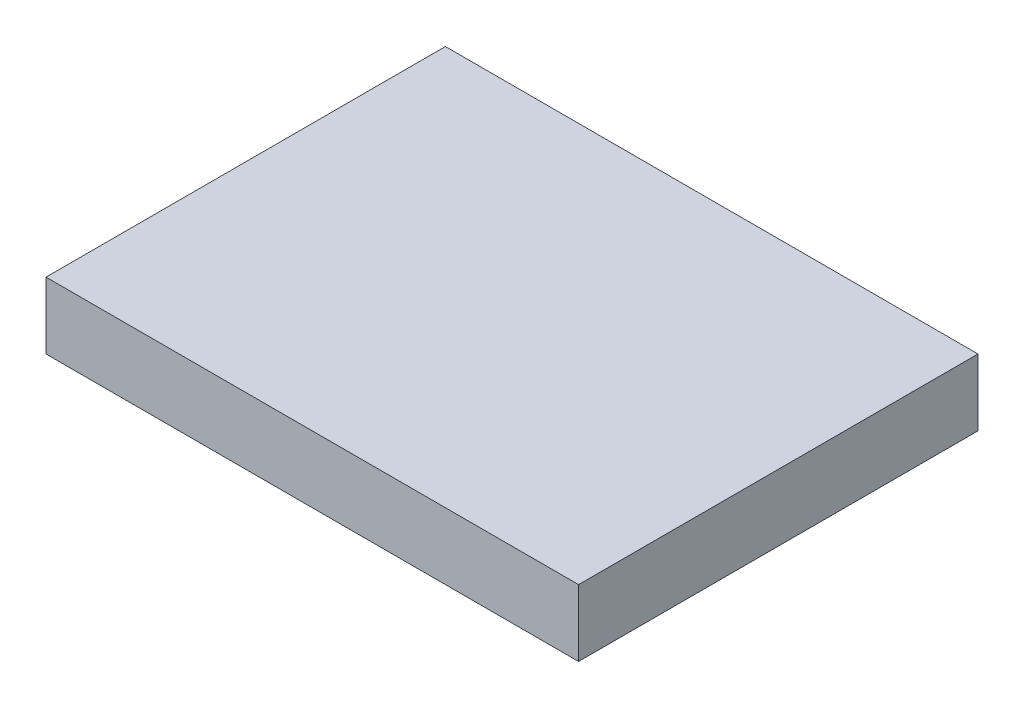
ISO-10303-21;
HEADER;
FILE_DESCRIPTION(('STEP AP214'),'2;1');
FILE_NAME('part.step','',(''),(''),'','','');
FILE_SCHEMA(('AUTOMOTIVE_DESIGN { 1 0 10303 214 1 1 1 1 }'));
ENDSEC;
DATA;
#1=APPLICATION_CONTEXT('core data for automotive mechanical design processes');
#2=APPLICATION_PROTOCOL_DEFINITION('international standard','automotive_design',2000,#1);
#3=PRODUCT_CONTEXT('',#1,'mechanical');
#4=PRODUCT('Part','Part','',(#3));
#5=PRODUCT_RELATED_PRODUCT_CATEGORY('part','',(#4));
#6=PRODUCT_DEFINITION_FORMATION('','',#4);
#7=PRODUCT_DEFINITION_CONTEXT('part definition',#1,'design');
#8=PRODUCT_DEFINITION('design','',#6,#7);
#9=PRODUCT_DEFINITION_SHAPE('','',#8);
#10=(LENGTH_UNIT() NAMED_UNIT(*) SI_UNIT(.MILLI.,.METRE.));
#11=(NAMED_UNIT(*) PLANE_ANGLE_UNIT() SI_UNIT($,.RADIAN.));
#12=(NAMED_UNIT(*) SI_UNIT($,.STERADIAN.) SOLID_ANGLE_UNIT());
#13=UNCERTAINTY_MEASURE_WITH_UNIT(LENGTH_MEASURE(1.E-05),#10,'distance_accuracy_value','');
#14=(GEOMETRIC_REPRESENTATION_CONTEXT(3) GLOBAL_UNCERTAINTY_ASSIGNED_CONTEXT((#13)) GLOBAL_UNIT_ASSIGNED_CONTEXT((#10,
#11,#12)) REPRESENTATION_CONTEXT('',''));
#15=CARTESIAN_POINT('',(0.,0.,0.));
#16=DIRECTION('',(0.,0.,1.));
#17=DIRECTION('',(1.,0.,0.));
#18=AXIS2_PLACEMENT_3D('',#15,#16,#17);
#19=CARTESIAN_POINT('',(24.,1.62,15.46));
#20=DIRECTION('',(0.,1.,0.));
#21=DIRECTION('',(0.,0.,1.));
#22=AXIS2_PLACEMENT_3D('',#19,#20,#21);
#23=PLANE('',#22);
#24=DIRECTION('',(0.,0.,1.));
#25=VECTOR('',#24,1.);
#26=CARTESIAN_POINT('',(23.2,1.62,15.16));
#27=LINE('',#26,#25);
#28=CARTESIAN_POINT('',(23.2,1.62,15.46));
#29=VERTEX_POINT('',#28);
#30=CARTESIAN_POINT('',(23.2,1.62,14.86));
#31=VERTEX_POINT('',#30);
#32=EDGE_CURVE('E55',#29,#31,#27,.F.);
#33=ORIENTED_EDGE('',*,*,#32,.F.);
#34=DIRECTION('',(1.,0.,0.));
#35=VECTOR('',#34,1.);
#36=CARTESIAN_POINT('',(24.,1.62,15.46));
#37=LINE('',#36,#35);
#38=CARTESIAN_POINT('',(24.,1.62,15.46));
#39=VERTEX_POINT('',#38);
#40=EDGE_CURVE('E67',#39,#29,#37,.F.);
#41=ORIENTED_EDGE('',*,*,#40,.F.);
#42=DIRECTION('',(0.,0.,1.));
#43=VECTOR('',#42,1.);
#44=CARTESIAN_POINT('',(24.,1.62,15.16));
#45=LINE('',#44,#43);
#46=CARTESIAN_POINT('',(24.,1.62,14.86));
#47=VERTEX_POINT('',#46);
#48=EDGE_CURVE('E20',#39,#47,#45,.F.);
#49=ORIENTED_EDGE('',*,*,#48,.T.);
#50=DIRECTION('',(-1.,0.,0.));
#51=VECTOR('',#50,1.);
#52=CARTESIAN_POINT('',(24.,1.62,14.86));
#53=LINE('',#52,#51);
#54=EDGE_CURVE('E81',#31,#47,#53,.F.);
#55=ORIENTED_EDGE('',*,*,#54,.F.);
#56=EDGE_LOOP('',(#33,#41,#49,#55));
#57=FACE_BOUND('',#56,.T.);
#58=ADVANCED_FACE('F17',(#57),#23,.T.);
#59=CARTESIAN_POINT('',(24.,1.57,15.16));
#60=DIRECTION('',(-1.,0.,0.));
#61=DIRECTION('',(0.,0.,1.));
#62=AXIS2_PLACEMENT_3D('',#59,#60,#61);
#63=PLANE('',#62);
#64=DIRECTION('',(0.,1.,0.));
#65=VECTOR('',#64,1.);
#66=CARTESIAN_POINT('',(24.,1.52,15.46));
#67=LINE('',#66,#65);
#68=CARTESIAN_POINT('',(24.,1.52,15.46));
#69=VERTEX_POINT('',#68);
#70=EDGE_CURVE('E62',#69,#39,#67,.T.);
#71=ORIENTED_EDGE('',*,*,#70,.F.);
#72=DIRECTION('',(0.,0.,-1.));
#73=VECTOR('',#72,1.);
#74=CARTESIAN_POINT('',(24.,1.52,14.86));
#75=LINE('',#74,#73);
#76=CARTESIAN_POINT('',(24.,1.52,14.86));
#77=VERTEX_POINT('',#76);
#78=EDGE_CURVE('E83',#77,#69,#75,.F.);
#79=ORIENTED_EDGE('',*,*,#78,.F.);
#80=DIRECTION('',(0.,1.,0.));
#81=VECTOR('',#80,1.);
#82=CARTESIAN_POINT('',(24.,1.62,14.86));
#83=LINE('',#82,#81);
#84=EDGE_CURVE('E65',#47,#77,#83,.F.);
#85=ORIENTED_EDGE('',*,*,#84,.F.);
#86=ORIENTED_EDGE('',*,*,#48,.F.);
#87=EDGE_LOOP('',(#71,#79,#85,#86));
#88=FACE_BOUND('',#87,.T.);
#89=ADVANCED_FACE('F60',(#88),#63,.F.);
#90=CARTESIAN_POINT('',(24.,1.52,15.46));
#91=DIRECTION('',(0.,0.,1.));
#92=DIRECTION('',(1.,0.,0.));
#93=AXIS2_PLACEMENT_3D('',#90,#91,#92);
#94=PLANE('',#93);
#95=DIRECTION('',(0.,1.,0.));
#96=VECTOR('',#95,1.);
#97=CARTESIAN_POINT('',(23.2,1.57,15.46));
#98=LINE('',#97,#96);
#99=CARTESIAN_POINT('',(23.2,1.52,15.46));
#100=VERTEX_POINT('',#99);
#101=EDGE_CURVE('E77',#100,#29,#98,.T.);
#102=ORIENTED_EDGE('',*,*,#101,.F.);
#103=DIRECTION('',(1.,0.,0.));
#104=VECTOR('',#103,1.);
#105=CARTESIAN_POINT('',(24.,1.52,15.46));
#106=LINE('',#105,#104);
#107=EDGE_CURVE('E73',#69,#100,#106,.F.);
#108=ORIENTED_EDGE('',*,*,#107,.F.);
#109=ORIENTED_EDGE('',*,*,#70,.T.);
#110=ORIENTED_EDGE('',*,*,#40,.T.);
#111=EDGE_LOOP('',(#102,#108,#109,#110));
#112=FACE_BOUND('',#111,.T.);
#113=ADVANCED_FACE('F71',(#112),#94,.T.);
#114=CARTESIAN_POINT('',(23.2,1.57,15.16));
#115=DIRECTION('',(-1.,0.,0.));
#116=DIRECTION('',(0.,0.,1.));
#117=AXIS2_PLACEMENT_3D('',#114,#115,#116);
#118=PLANE('',#117);
#119=DIRECTION('',(0.,0.,-1.));
#120=VECTOR('',#119,1.);
#121=CARTESIAN_POINT('',(23.2,1.52,14.86));
#122=LINE('',#121,#120);
#123=CARTESIAN_POINT('',(23.2,1.52,14.86));
#124=VERTEX_POINT('',#123);
#125=EDGE_CURVE('E26',#100,#124,#122,.T.);
#126=ORIENTED_EDGE('',*,*,#125,.F.);
#127=ORIENTED_EDGE('',*,*,#101,.T.);
#128=ORIENTED_EDGE('',*,*,#32,.T.);
#129=DIRECTION('',(0.,1.,0.));
#130=VECTOR('',#129,1.);
#131=CARTESIAN_POINT('',(23.2,1.62,14.86));
#132=LINE('',#131,#130);
#133=EDGE_CURVE('E35',#124,#31,#132,.T.);
#134=ORIENTED_EDGE('',*,*,#133,.F.);
#135=EDGE_LOOP('',(#126,#127,#128,#134));
#136=FACE_BOUND('',#135,.T.);
#137=ADVANCED_FACE('F89',(#136),#118,.T.);
#138=CARTESIAN_POINT('',(24.,1.62,14.86));
#139=DIRECTION('',(0.,0.,-1.));
#140=DIRECTION('',(-1.,0.,0.));
#141=AXIS2_PLACEMENT_3D('',#138,#139,#140);
#142=PLANE('',#141);
#143=ORIENTED_EDGE('',*,*,#133,.T.);
#144=ORIENTED_EDGE('',*,*,#54,.T.);
#145=ORIENTED_EDGE('',*,*,#84,.T.);
#146=DIRECTION('',(1.,0.,0.));
#147=VECTOR('',#146,1.);
#148=CARTESIAN_POINT('',(24.,1.52,14.86));
#149=LINE('',#148,#147);
#150=EDGE_CURVE('E11',#124,#77,#149,.T.);
#151=ORIENTED_EDGE('',*,*,#150,.F.);
#152=EDGE_LOOP('',(#143,#144,#145,#151));
#153=FACE_BOUND('',#152,.T.);
#154=ADVANCED_FACE('F91',(#153),#142,.T.);
#155=CARTESIAN_POINT('',(24.,1.52,14.86));
#156=DIRECTION('',(0.,-1.,0.));
#157=DIRECTION('',(0.,0.,-1.));
#158=AXIS2_PLACEMENT_3D('',#155,#156,#157);
#159=PLANE('',#158);
#160=ORIENTED_EDGE('',*,*,#125,.T.);
#161=ORIENTED_EDGE('',*,*,#150,.T.);
#162=ORIENTED_EDGE('',*,*,#78,.T.);
#163=ORIENTED_EDGE('',*,*,#107,.T.);
#164=EDGE_LOOP('',(#160,#161,#162,#163));
#165=FACE_BOUND('',#164,.T.);
#166=ADVANCED_FACE('F88',(#165),#159,.T.);
#167=CLOSED_SHELL('',(#58,#89,#113,#137,#154,#166));
#168=MANIFOLD_SOLID_BREP('B1',#167);
#169=ADVANCED_BREP_SHAPE_REPRESENTATION('',(#18,#168),#14);
#170=SHAPE_DEFINITION_REPRESENTATION(#9,#169);
ENDSEC;
END-ISO-10303-21;
